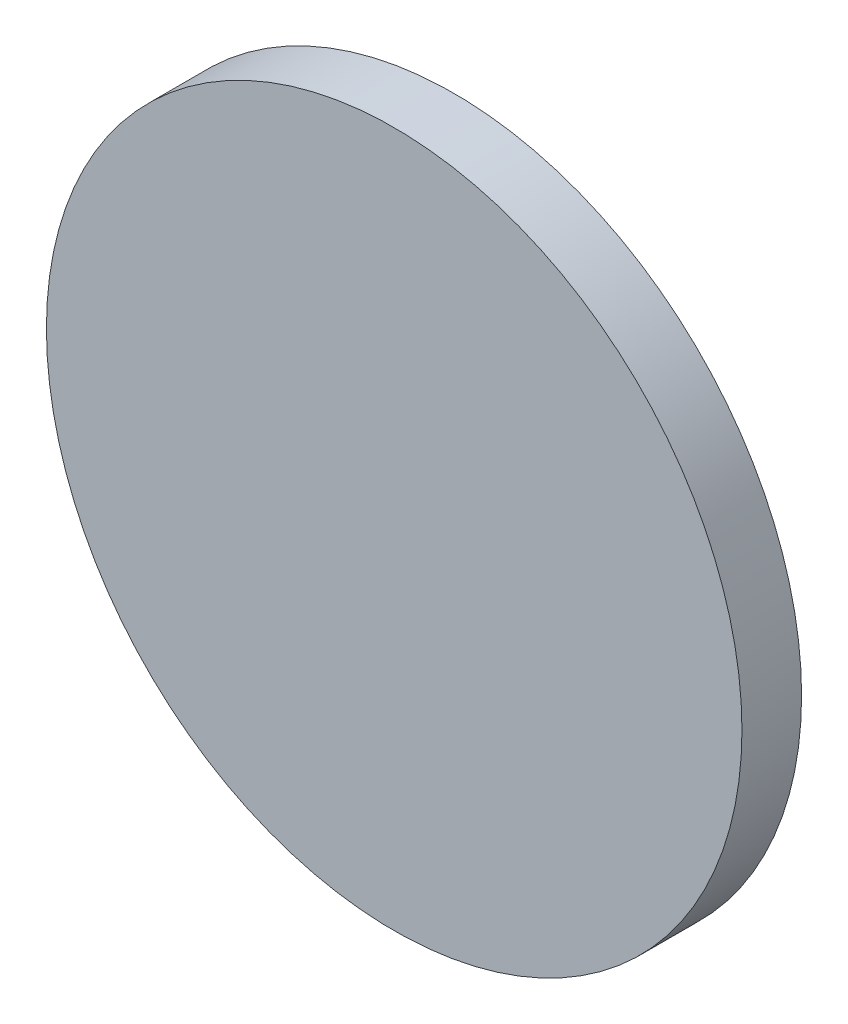
ISO-10303-21;
HEADER;
FILE_DESCRIPTION(('STEP AP214'),'2;1');
FILE_NAME('part.step','',(''),(''),'','','');
FILE_SCHEMA(('AUTOMOTIVE_DESIGN { 1 0 10303 214 1 1 1 1 }'));
ENDSEC;
DATA;
#1=APPLICATION_CONTEXT('core data for automotive mechanical design processes');
#2=APPLICATION_PROTOCOL_DEFINITION('international standard','automotive_design',2000,#1);
#3=PRODUCT_CONTEXT('',#1,'mechanical');
#4=PRODUCT('Part','Part','',(#3));
#5=PRODUCT_RELATED_PRODUCT_CATEGORY('part','',(#4));
#6=PRODUCT_DEFINITION_FORMATION('','',#4);
#7=PRODUCT_DEFINITION_CONTEXT('part definition',#1,'design');
#8=PRODUCT_DEFINITION('design','',#6,#7);
#9=PRODUCT_DEFINITION_SHAPE('','',#8);
#10=(LENGTH_UNIT() NAMED_UNIT(*) SI_UNIT(.MILLI.,.METRE.));
#11=(NAMED_UNIT(*) PLANE_ANGLE_UNIT() SI_UNIT($,.RADIAN.));
#12=(NAMED_UNIT(*) SI_UNIT($,.STERADIAN.) SOLID_ANGLE_UNIT());
#13=UNCERTAINTY_MEASURE_WITH_UNIT(LENGTH_MEASURE(1.E-05),#10,'distance_accuracy_value','');
#14=(GEOMETRIC_REPRESENTATION_CONTEXT(3) GLOBAL_UNCERTAINTY_ASSIGNED_CONTEXT((#13)) GLOBAL_UNIT_ASSIGNED_CONTEXT((#10,
#11,#12)) REPRESENTATION_CONTEXT('',''));
#15=CARTESIAN_POINT('',(0.,0.,0.));
#16=DIRECTION('',(0.,0.,1.));
#17=DIRECTION('',(1.,0.,0.));
#18=AXIS2_PLACEMENT_3D('',#15,#16,#17);
#19=CARTESIAN_POINT('',(11.35342,4.640580014875,0.03429));
#20=DIRECTION('',(0.,0.,1.));
#21=DIRECTION('',(1.,0.,0.));
#22=AXIS2_PLACEMENT_3D('',#19,#20,#21);
#23=PLANE('',#22);
#24=CARTESIAN_POINT('',(11.35342,4.640580014875,0.03429));
#25=DIRECTION('',(0.,0.,1.));
#26=DIRECTION('',(1.,0.,0.));
#27=AXIS2_PLACEMENT_3D('',#24,#25,#26);
#28=CIRCLE('',#27,0.200024667);
#29=CARTESIAN_POINT('',(11.553444667,4.640580014875,0.03429));
#30=VERTEX_POINT('',#29);
#31=EDGE_CURVE('E18',#30,#30,#28,.F.);
#32=ORIENTED_EDGE('',*,*,#31,.F.);
#33=EDGE_LOOP('',(#32));
#34=FACE_BOUND('',#33,.T.);
#35=ADVANCED_FACE('F15',(#34),#23,.T.);
#36=CARTESIAN_POINT('',(11.35342,4.640580014875,0.));
#37=DIRECTION('',(0.,0.,1.));
#38=DIRECTION('',(1.,0.,0.));
#39=AXIS2_PLACEMENT_3D('',#36,#37,#38);
#40=CYLINDRICAL_SURFACE('',#39,0.200024667);
#41=ORIENTED_EDGE('',*,*,#31,.T.);
#42=EDGE_LOOP('',(#41));
#43=FACE_BOUND('',#42,.T.);
#44=CARTESIAN_POINT('',(11.35342,4.640580014875,0.));
#45=DIRECTION('',(0.,0.,1.));
#46=DIRECTION('',(1.,0.,0.));
#47=AXIS2_PLACEMENT_3D('',#44,#45,#46);
#48=CIRCLE('',#47,0.200024667);
#49=CARTESIAN_POINT('',(11.553444667,4.640580014875,0.));
#50=VERTEX_POINT('',#49);
#51=EDGE_CURVE('E10',#50,#50,#48,.F.);
#52=ORIENTED_EDGE('',*,*,#51,.F.);
#53=EDGE_LOOP('',(#52));
#54=FACE_BOUND('',#53,.T.);
#55=ADVANCED_FACE('F27',(#43,#54),#40,.T.);
#56=CARTESIAN_POINT('',(11.35342,4.640580014875,0.));
#57=DIRECTION('',(0.,0.,-1.));
#58=DIRECTION('',(-1.,0.,0.));
#59=AXIS2_PLACEMENT_3D('',#56,#57,#58);
#60=PLANE('',#59);
#61=ORIENTED_EDGE('',*,*,#51,.T.);
#62=EDGE_LOOP('',(#61));
#63=FACE_BOUND('',#62,.T.);
#64=ADVANCED_FACE('F35',(#63),#60,.T.);
#65=CLOSED_SHELL('',(#35,#55,#64));
#66=MANIFOLD_SOLID_BREP('B1',#65);
#67=ADVANCED_BREP_SHAPE_REPRESENTATION('',(#18,#66),#14);
#68=SHAPE_DEFINITION_REPRESENTATION(#9,#67);
ENDSEC;
END-ISO-10303-21;
